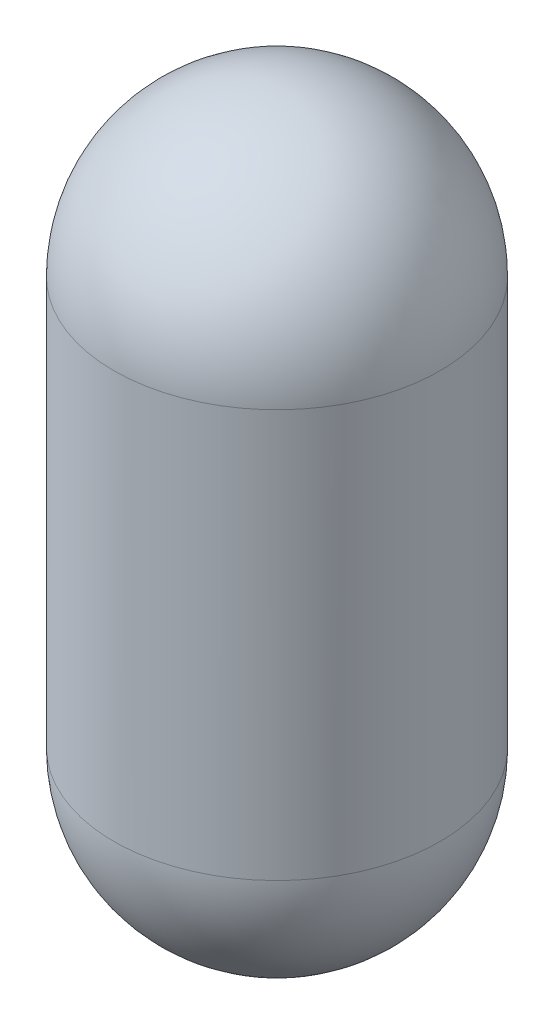
ISO-10303-21;
HEADER;
FILE_DESCRIPTION(('STEP AP214'),'2;1');
FILE_NAME('part.step','',(''),(''),'','','');
FILE_SCHEMA(('AUTOMOTIVE_DESIGN { 1 0 10303 214 1 1 1 1 }'));
ENDSEC;
DATA;
#1=APPLICATION_CONTEXT('core data for automotive mechanical design processes');
#2=APPLICATION_PROTOCOL_DEFINITION('international standard','automotive_design',2000,#1);
#3=PRODUCT_CONTEXT('',#1,'mechanical');
#4=PRODUCT('Part','Part','',(#3));
#5=PRODUCT_RELATED_PRODUCT_CATEGORY('part','',(#4));
#6=PRODUCT_DEFINITION_FORMATION('','',#4);
#7=PRODUCT_DEFINITION_CONTEXT('part definition',#1,'design');
#8=PRODUCT_DEFINITION('design','',#6,#7);
#9=PRODUCT_DEFINITION_SHAPE('','',#8);
#10=(LENGTH_UNIT() NAMED_UNIT(*) SI_UNIT(.MILLI.,.METRE.));
#11=(NAMED_UNIT(*) PLANE_ANGLE_UNIT() SI_UNIT($,.RADIAN.));
#12=(NAMED_UNIT(*) SI_UNIT($,.STERADIAN.) SOLID_ANGLE_UNIT());
#13=UNCERTAINTY_MEASURE_WITH_UNIT(LENGTH_MEASURE(1.E-05),#10,'distance_accuracy_value','');
#14=(GEOMETRIC_REPRESENTATION_CONTEXT(3) GLOBAL_UNCERTAINTY_ASSIGNED_CONTEXT((#13)) GLOBAL_UNIT_ASSIGNED_CONTEXT((#10,
#11,#12)) REPRESENTATION_CONTEXT('',''));
#15=CARTESIAN_POINT('',(0.,0.,0.));
#16=DIRECTION('',(0.,0.,1.));
#17=DIRECTION('',(1.,0.,0.));
#18=AXIS2_PLACEMENT_3D('',#15,#16,#17);
#19=CARTESIAN_POINT('',(0.,0.,0.));
#20=DIRECTION('',(0.,1.,0.));
#21=DIRECTION('',(0.,0.,-1.));
#22=AXIS2_PLACEMENT_3D('',#19,#20,#21);
#23=SPHERICAL_SURFACE('',#22,40.);
#24=CARTESIAN_POINT('',(0.,0.,0.));
#25=DIRECTION('',(0.,1.,0.));
#26=DIRECTION('',(0.,0.,1.));
#27=AXIS2_PLACEMENT_3D('',#24,#25,#26);
#28=CIRCLE('',#27,40.);
#29=CARTESIAN_POINT('',(0.,0.,40.));
#30=VERTEX_POINT('',#29);
#31=EDGE_CURVE('E46',#30,#30,#28,.T.);
#32=ORIENTED_EDGE('',*,*,#31,.T.);
#33=EDGE_LOOP('',(#32));
#34=FACE_BOUND('',#33,.T.);
#35=ADVANCED_FACE('F37',(#34),#23,.T.);
#36=CARTESIAN_POINT('',(0.,-100.,0.));
#37=DIRECTION('',(0.,-1.,0.));
#38=DIRECTION('',(0.,0.,-1.));
#39=AXIS2_PLACEMENT_3D('',#36,#37,#38);
#40=SPHERICAL_SURFACE('',#39,40.);
#41=CARTESIAN_POINT('',(0.,-100.,0.));
#42=DIRECTION('',(0.,-1.,0.));
#43=DIRECTION('',(0.,0.,-1.));
#44=AXIS2_PLACEMENT_3D('',#41,#42,#43);
#45=CIRCLE('',#44,40.);
#46=CARTESIAN_POINT('',(0.,-100.,-40.));
#47=VERTEX_POINT('',#46);
#48=EDGE_CURVE('E102',#47,#47,#45,.T.);
#49=ORIENTED_EDGE('',*,*,#48,.T.);
#50=EDGE_LOOP('',(#49));
#51=FACE_BOUND('',#50,.T.);
#52=ADVANCED_FACE('F133',(#51),#40,.T.);
#53=CARTESIAN_POINT('',(0.,-100.,0.));
#54=DIRECTION('',(0.,1.,0.));
#55=DIRECTION('',(0.,0.,1.));
#56=AXIS2_PLACEMENT_3D('',#53,#54,#55);
#57=CYLINDRICAL_SURFACE('',#56,40.);
#58=ORIENTED_EDGE('',*,*,#48,.F.);
#59=EDGE_LOOP('',(#58));
#60=FACE_BOUND('',#59,.T.);
#61=ORIENTED_EDGE('',*,*,#31,.F.);
#62=EDGE_LOOP('',(#61));
#63=FACE_BOUND('',#62,.T.);
#64=ADVANCED_FACE('F39',(#60,#63),#57,.T.);
#65=CLOSED_SHELL('',(#35,#52,#64));
#66=CARTESIAN_POINT('',(0.,0.,0.));
#67=DIRECTION('',(0.,1.,0.));
#68=DIRECTION('',(0.,0.,1.));
#69=AXIS2_PLACEMENT_3D('',#66,#67,#68);
#70=PLANE('',#69);
#71=CARTESIAN_POINT('',(15.,0.,0.));
#72=DIRECTION('',(0.,1.,0.));
#73=DIRECTION('',(0.,0.,1.));
#74=AXIS2_PLACEMENT_3D('',#71,#72,#73);
#75=CIRCLE('',#74,2.5);
#76=CARTESIAN_POINT('',(15.,0.,2.5));
#77=VERTEX_POINT('',#76);
#78=EDGE_CURVE('E196',#77,#77,#75,.T.);
#79=ORIENTED_EDGE('',*,*,#78,.F.);
#80=EDGE_LOOP('',(#79));
#81=FACE_BOUND('',#80,.T.);
#82=CARTESIAN_POINT('',(-15.,0.,0.));
#83=DIRECTION('',(0.,1.,0.));
#84=DIRECTION('',(0.,0.,1.));
#85=AXIS2_PLACEMENT_3D('',#82,#83,#84);
#86=CIRCLE('',#85,2.5);
#87=CARTESIAN_POINT('',(-15.,0.,2.5));
#88=VERTEX_POINT('',#87);
#89=EDGE_CURVE('E200',#88,#88,#86,.T.);
#90=ORIENTED_EDGE('',*,*,#89,.F.);
#91=EDGE_LOOP('',(#90));
#92=FACE_BOUND('',#91,.T.);
#93=CARTESIAN_POINT('',(0.,0.,0.));
#94=DIRECTION('',(0.,1.,0.));
#95=DIRECTION('',(0.,0.,1.));
#96=AXIS2_PLACEMENT_3D('',#93,#94,#95);
#97=CIRCLE('',#96,35.);
#98=CARTESIAN_POINT('',(0.,0.,35.));
#99=VERTEX_POINT('',#98);
#100=EDGE_CURVE('E11',#99,#99,#97,.F.);
#101=ORIENTED_EDGE('',*,*,#100,.F.);
#102=EDGE_LOOP('',(#101));
#103=FACE_BOUND('',#102,.T.);
#104=ADVANCED_FACE('F180',(#81,#92,#103),#70,.T.);
#105=CARTESIAN_POINT('',(0.,-100.,0.));
#106=DIRECTION('',(0.,1.,0.));
#107=DIRECTION('',(0.,0.,1.));
#108=AXIS2_PLACEMENT_3D('',#105,#106,#107);
#109=CYLINDRICAL_SURFACE('',#108,35.);
#110=CARTESIAN_POINT('',(0.,-5.,0.));
#111=DIRECTION('',(0.,1.,0.));
#112=DIRECTION('',(0.,0.,1.));
#113=AXIS2_PLACEMENT_3D('',#110,#111,#112);
#114=CIRCLE('',#113,35.);
#115=CARTESIAN_POINT('',(2.50000000000002,-5.,-34.9106001094224));
#116=VERTEX_POINT('',#115);
#117=CARTESIAN_POINT('',(2.5,-5.,34.9106001094224));
#118=VERTEX_POINT('',#117);
#119=EDGE_CURVE('E89',#116,#118,#114,.F.);
#120=ORIENTED_EDGE('',*,*,#119,.F.);
#121=DIRECTION('',(0.,1.,0.));
#122=VECTOR('',#121,1.);
#123=CARTESIAN_POINT('',(2.50000000000002,-100.,-34.9106001094224));
#124=LINE('',#123,#122);
#125=CARTESIAN_POINT('',(2.50000000000002,-100.,-34.9106001094224));
#126=VERTEX_POINT('',#125);
#127=EDGE_CURVE('E79',#126,#116,#124,.T.);
#128=ORIENTED_EDGE('',*,*,#127,.F.);
#129=CARTESIAN_POINT('',(0.,-100.,0.));
#130=DIRECTION('',(0.,1.,0.));
#131=DIRECTION('',(0.,0.,-1.));
#132=AXIS2_PLACEMENT_3D('',#129,#130,#131);
#133=CIRCLE('',#132,35.);
#134=CARTESIAN_POINT('',(2.5,-100.,34.9106001094224));
#135=VERTEX_POINT('',#134);
#136=EDGE_CURVE('E111',#135,#126,#133,.T.);
#137=ORIENTED_EDGE('',*,*,#136,.F.);
#138=DIRECTION('',(0.,1.,0.));
#139=VECTOR('',#138,1.);
#140=CARTESIAN_POINT('',(2.5,-100.,34.9106001094224));
#141=LINE('',#140,#139);
#142=EDGE_CURVE('E86',#135,#118,#141,.T.);
#143=ORIENTED_EDGE('',*,*,#142,.T.);
#144=EDGE_LOOP('',(#120,#128,#137,#143));
#145=FACE_BOUND('',#144,.T.);
#146=ADVANCED_FACE('F90',(#145),#109,.F.);
#147=CARTESIAN_POINT('',(2.50000000000002,-100.,-34.9106001094224));
#148=DIRECTION('',(-1.,0.,0.));
#149=DIRECTION('',(0.,0.,1.));
#150=AXIS2_PLACEMENT_3D('',#147,#148,#149);
#151=PLANE('',#150);
#152=CARTESIAN_POINT('',(2.50000000000001,-75.,0.));
#153=DIRECTION('',(1.,0.,0.));
#154=DIRECTION('',(0.,0.,-1.));
#155=AXIS2_PLACEMENT_3D('',#152,#153,#154);
#156=CIRCLE('',#155,15.);
#157=CARTESIAN_POINT('',(2.50000000000001,-75.,-15.));
#158=VERTEX_POINT('',#157);
#159=EDGE_CURVE('E112',#158,#158,#156,.T.);
#160=ORIENTED_EDGE('',*,*,#159,.F.);
#161=EDGE_LOOP('',(#160));
#162=FACE_BOUND('',#161,.T.);
#163=DIRECTION('',(0.,0.,1.));
#164=VECTOR('',#163,1.);
#165=CARTESIAN_POINT('',(2.50000000000001,-5.,0.));
#166=LINE('',#165,#164);
#167=EDGE_CURVE('E53',#116,#118,#166,.T.);
#168=ORIENTED_EDGE('',*,*,#167,.T.);
#169=ORIENTED_EDGE('',*,*,#142,.F.);
#170=DIRECTION('',(0.,0.,1.));
#171=VECTOR('',#170,1.);
#172=CARTESIAN_POINT('',(2.50000000000002,-100.,-34.9106001094224));
#173=LINE('',#172,#171);
#174=EDGE_CURVE('E83',#126,#135,#173,.T.);
#175=ORIENTED_EDGE('',*,*,#174,.F.);
#176=ORIENTED_EDGE('',*,*,#127,.T.);
#177=EDGE_LOOP('',(#168,#169,#175,#176));
#178=FACE_BOUND('',#177,.T.);
#179=ADVANCED_FACE('F81',(#162,#178),#151,.F.);
#180=CARTESIAN_POINT('',(0.,-100.,0.));
#181=DIRECTION('',(0.,1.,0.));
#182=DIRECTION('',(0.,0.,1.));
#183=AXIS2_PLACEMENT_3D('',#180,#181,#182);
#184=CYLINDRICAL_SURFACE('',#183,35.);
#185=CARTESIAN_POINT('',(0.,-5.,0.));
#186=DIRECTION('',(0.,1.,0.));
#187=DIRECTION('',(0.,0.,1.));
#188=AXIS2_PLACEMENT_3D('',#185,#186,#187);
#189=CIRCLE('',#188,35.);
#190=CARTESIAN_POINT('',(-2.50000000000002,-5.,-34.9106001094224));
#191=VERTEX_POINT('',#190);
#192=CARTESIAN_POINT('',(-2.5,-5.,34.9106001094224));
#193=VERTEX_POINT('',#192);
#194=EDGE_CURVE('E96',#191,#193,#189,.T.);
#195=ORIENTED_EDGE('',*,*,#194,.T.);
#196=DIRECTION('',(0.,1.,0.));
#197=VECTOR('',#196,1.);
#198=CARTESIAN_POINT('',(-2.5,-100.,34.9106001094224));
#199=LINE('',#198,#197);
#200=CARTESIAN_POINT('',(-2.5,-100.,34.9106001094224));
#201=VERTEX_POINT('',#200);
#202=EDGE_CURVE('E125',#201,#193,#199,.T.);
#203=ORIENTED_EDGE('',*,*,#202,.F.);
#204=CARTESIAN_POINT('',(0.,-100.,0.));
#205=DIRECTION('',(0.,1.,0.));
#206=DIRECTION('',(0.,0.,1.));
#207=AXIS2_PLACEMENT_3D('',#204,#205,#206);
#208=CIRCLE('',#207,35.);
#209=CARTESIAN_POINT('',(-2.50000000000002,-100.,-34.9106001094224));
#210=VERTEX_POINT('',#209);
#211=EDGE_CURVE('E118',#210,#201,#208,.T.);
#212=ORIENTED_EDGE('',*,*,#211,.F.);
#213=DIRECTION('',(0.,1.,0.));
#214=VECTOR('',#213,1.);
#215=CARTESIAN_POINT('',(-2.50000000000002,-100.,-34.9106001094224));
#216=LINE('',#215,#214);
#217=EDGE_CURVE('E126',#210,#191,#216,.T.);
#218=ORIENTED_EDGE('',*,*,#217,.T.);
#219=EDGE_LOOP('',(#195,#203,#212,#218));
#220=FACE_BOUND('',#219,.T.);
#221=ADVANCED_FACE('F176',(#220),#184,.F.);
#222=CARTESIAN_POINT('',(-2.50000000000002,-100.,-34.9106001094224));
#223=DIRECTION('',(1.,0.,0.));
#224=DIRECTION('',(0.,0.,-1.));
#225=AXIS2_PLACEMENT_3D('',#222,#223,#224);
#226=PLANE('',#225);
#227=CARTESIAN_POINT('',(-2.49999999999999,-75.,0.));
#228=DIRECTION('',(1.,0.,0.));
#229=DIRECTION('',(0.,0.,-1.));
#230=AXIS2_PLACEMENT_3D('',#227,#228,#229);
#231=CIRCLE('',#230,15.);
#232=CARTESIAN_POINT('',(-2.49999999999999,-75.,-15.));
#233=VERTEX_POINT('',#232);
#234=EDGE_CURVE('E108',#233,#233,#231,.T.);
#235=ORIENTED_EDGE('',*,*,#234,.T.);
#236=EDGE_LOOP('',(#235));
#237=FACE_BOUND('',#236,.T.);
#238=DIRECTION('',(0.,0.,1.));
#239=VECTOR('',#238,1.);
#240=CARTESIAN_POINT('',(-2.50000000000001,-5.,0.));
#241=LINE('',#240,#239);
#242=EDGE_CURVE('E61',#191,#193,#241,.T.);
#243=ORIENTED_EDGE('',*,*,#242,.F.);
#244=ORIENTED_EDGE('',*,*,#217,.F.);
#245=DIRECTION('',(0.,0.,-1.));
#246=VECTOR('',#245,1.);
#247=CARTESIAN_POINT('',(-2.50000000000002,-100.,-34.9106001094224));
#248=LINE('',#247,#246);
#249=EDGE_CURVE('E122',#201,#210,#248,.T.);
#250=ORIENTED_EDGE('',*,*,#249,.F.);
#251=ORIENTED_EDGE('',*,*,#202,.T.);
#252=EDGE_LOOP('',(#243,#244,#250,#251));
#253=FACE_BOUND('',#252,.T.);
#254=ADVANCED_FACE('F181',(#237,#253),#226,.F.);
#255=CARTESIAN_POINT('',(0.,-100.,0.));
#256=DIRECTION('',(0.,1.,0.));
#257=DIRECTION('',(0.,0.,1.));
#258=AXIS2_PLACEMENT_3D('',#255,#256,#257);
#259=PLANE('',#258);
#260=ORIENTED_EDGE('',*,*,#249,.T.);
#261=CARTESIAN_POINT('',(0.,-100.,0.));
#262=DIRECTION('',(0.,-1.,0.));
#263=DIRECTION('',(0.,0.,-1.));
#264=AXIS2_PLACEMENT_3D('',#261,#262,#263);
#265=CIRCLE('',#264,35.);
#266=EDGE_CURVE('E105',#210,#126,#265,.T.);
#267=ORIENTED_EDGE('',*,*,#266,.T.);
#268=ORIENTED_EDGE('',*,*,#174,.T.);
#269=EDGE_CURVE('E107',#135,#201,#265,.T.);
#270=ORIENTED_EDGE('',*,*,#269,.T.);
#271=EDGE_LOOP('',(#260,#267,#268,#270));
#272=FACE_BOUND('',#271,.T.);
#273=ADVANCED_FACE('F172',(#272),#259,.F.);
#274=CARTESIAN_POINT('',(-2.49999999999999,-75.,0.));
#275=DIRECTION('',(1.,0.,0.));
#276=DIRECTION('',(0.,0.,-1.));
#277=AXIS2_PLACEMENT_3D('',#274,#275,#276);
#278=CYLINDRICAL_SURFACE('',#277,15.);
#279=ORIENTED_EDGE('',*,*,#234,.F.);
#280=EDGE_LOOP('',(#279));
#281=FACE_BOUND('',#280,.T.);
#282=ORIENTED_EDGE('',*,*,#159,.T.);
#283=EDGE_LOOP('',(#282));
#284=FACE_BOUND('',#283,.T.);
#285=ADVANCED_FACE('F167',(#281,#284),#278,.F.);
#286=CARTESIAN_POINT('',(0.,-100.,0.));
#287=DIRECTION('',(0.,-1.,0.));
#288=DIRECTION('',(0.,0.,-1.));
#289=AXIS2_PLACEMENT_3D('',#286,#287,#288);
#290=SPHERICAL_SURFACE('',#289,35.);
#291=ORIENTED_EDGE('',*,*,#136,.T.);
#292=ORIENTED_EDGE('',*,*,#266,.F.);
#293=ORIENTED_EDGE('',*,*,#211,.T.);
#294=ORIENTED_EDGE('',*,*,#269,.F.);
#295=EDGE_LOOP('',(#291,#292,#293,#294));
#296=FACE_BOUND('',#295,.T.);
#297=ADVANCED_FACE('F164',(#296),#290,.F.);
#298=CARTESIAN_POINT('',(0.,-5.,0.));
#299=DIRECTION('',(0.,1.,0.));
#300=DIRECTION('',(0.,0.,1.));
#301=AXIS2_PLACEMENT_3D('',#298,#299,#300);
#302=PLANE('',#301);
#303=CARTESIAN_POINT('',(-15.,-5.,0.));
#304=DIRECTION('',(0.,1.,0.));
#305=DIRECTION('',(0.,0.,1.));
#306=AXIS2_PLACEMENT_3D('',#303,#304,#305);
#307=CIRCLE('',#306,2.5);
#308=CARTESIAN_POINT('',(-15.,-5.,2.5));
#309=VERTEX_POINT('',#308);
#310=EDGE_CURVE('E92',#309,#309,#307,.T.);
#311=ORIENTED_EDGE('',*,*,#310,.T.);
#312=EDGE_LOOP('',(#311));
#313=FACE_BOUND('',#312,.T.);
#314=ORIENTED_EDGE('',*,*,#242,.T.);
#315=ORIENTED_EDGE('',*,*,#194,.F.);
#316=EDGE_LOOP('',(#314,#315));
#317=FACE_BOUND('',#316,.T.);
#318=ADVANCED_FACE('F160',(#313,#317),#302,.F.);
#319=CARTESIAN_POINT('',(0.,-5.,0.));
#320=DIRECTION('',(0.,1.,0.));
#321=DIRECTION('',(0.,0.,1.));
#322=AXIS2_PLACEMENT_3D('',#319,#320,#321);
#323=PLANE('',#322);
#324=CARTESIAN_POINT('',(15.,-5.,0.));
#325=DIRECTION('',(0.,1.,0.));
#326=DIRECTION('',(0.,0.,1.));
#327=AXIS2_PLACEMENT_3D('',#324,#325,#326);
#328=CIRCLE('',#327,2.5);
#329=CARTESIAN_POINT('',(15.,-5.,2.5));
#330=VERTEX_POINT('',#329);
#331=EDGE_CURVE('E301',#330,#330,#328,.T.);
#332=ORIENTED_EDGE('',*,*,#331,.T.);
#333=EDGE_LOOP('',(#332));
#334=FACE_BOUND('',#333,.T.);
#335=ORIENTED_EDGE('',*,*,#119,.T.);
#336=ORIENTED_EDGE('',*,*,#167,.F.);
#337=EDGE_LOOP('',(#335,#336));
#338=FACE_BOUND('',#337,.T.);
#339=ADVANCED_FACE('F94',(#334,#338),#323,.F.);
#340=CARTESIAN_POINT('',(15.,-5.,0.));
#341=DIRECTION('',(0.,1.,0.));
#342=DIRECTION('',(0.,0.,1.));
#343=AXIS2_PLACEMENT_3D('',#340,#341,#342);
#344=CYLINDRICAL_SURFACE('',#343,2.5);
#345=ORIENTED_EDGE('',*,*,#331,.F.);
#346=EDGE_LOOP('',(#345));
#347=FACE_BOUND('',#346,.T.);
#348=ORIENTED_EDGE('',*,*,#78,.T.);
#349=EDGE_LOOP('',(#348));
#350=FACE_BOUND('',#349,.T.);
#351=ADVANCED_FACE('F152',(#347,#350),#344,.F.);
#352=CARTESIAN_POINT('',(-15.,-5.,0.));
#353=DIRECTION('',(0.,1.,0.));
#354=DIRECTION('',(0.,0.,1.));
#355=AXIS2_PLACEMENT_3D('',#352,#353,#354);
#356=CYLINDRICAL_SURFACE('',#355,2.5);
#357=ORIENTED_EDGE('',*,*,#310,.F.);
#358=EDGE_LOOP('',(#357));
#359=FACE_BOUND('',#358,.T.);
#360=ORIENTED_EDGE('',*,*,#89,.T.);
#361=EDGE_LOOP('',(#360));
#362=FACE_BOUND('',#361,.T.);
#363=ADVANCED_FACE('F149',(#359,#362),#356,.F.);
#364=CARTESIAN_POINT('',(0.,0.,0.));
#365=DIRECTION('',(0.,1.,0.));
#366=DIRECTION('',(0.,0.,-1.));
#367=AXIS2_PLACEMENT_3D('',#364,#365,#366);
#368=SPHERICAL_SURFACE('',#367,35.);
#369=ORIENTED_EDGE('',*,*,#100,.T.);
#370=EDGE_LOOP('',(#369));
#371=FACE_BOUND('',#370,.T.);
#372=ADVANCED_FACE('F148',(#371),#368,.F.);
#373=CLOSED_SHELL('',(#104,#146,#179,#221,#254,#273,#285,#297,#318,#339,#351,#363,#372));
#374=ORIENTED_CLOSED_SHELL('',*,#65,.T.);
#375=BREP_WITH_VOIDS('B2',#373,(#374));
#376=ADVANCED_BREP_SHAPE_REPRESENTATION('',(#18,#375),#14);
#377=SHAPE_DEFINITION_REPRESENTATION(#9,#376);
ENDSEC;
END-ISO-10303-21;
